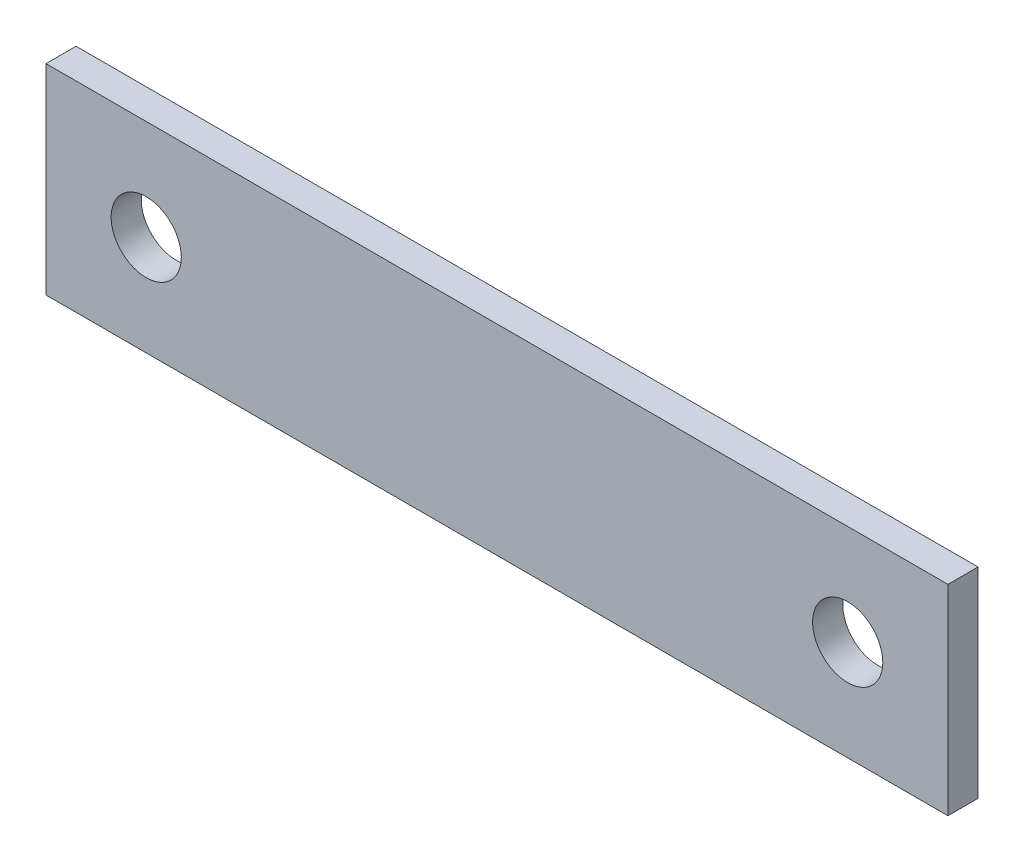
ISO-10303-21;
HEADER;
FILE_DESCRIPTION(('STEP AP214'),'2;1');
FILE_NAME('part.step','',(''),(''),'','','');
FILE_SCHEMA(('AUTOMOTIVE_DESIGN { 1 0 10303 214 1 1 1 1 }'));
ENDSEC;
DATA;
#1=APPLICATION_CONTEXT('core data for automotive mechanical design processes');
#2=APPLICATION_PROTOCOL_DEFINITION('international standard','automotive_design',2000,#1);
#3=PRODUCT_CONTEXT('',#1,'mechanical');
#4=PRODUCT('Part','Part','',(#3));
#5=PRODUCT_RELATED_PRODUCT_CATEGORY('part','',(#4));
#6=PRODUCT_DEFINITION_FORMATION('','',#4);
#7=PRODUCT_DEFINITION_CONTEXT('part definition',#1,'design');
#8=PRODUCT_DEFINITION('design','',#6,#7);
#9=PRODUCT_DEFINITION_SHAPE('','',#8);
#10=(LENGTH_UNIT() NAMED_UNIT(*) SI_UNIT(.MILLI.,.METRE.));
#11=(NAMED_UNIT(*) PLANE_ANGLE_UNIT() SI_UNIT($,.RADIAN.));
#12=(NAMED_UNIT(*) SI_UNIT($,.STERADIAN.) SOLID_ANGLE_UNIT());
#13=UNCERTAINTY_MEASURE_WITH_UNIT(LENGTH_MEASURE(1.E-05),#10,'distance_accuracy_value','');
#14=(GEOMETRIC_REPRESENTATION_CONTEXT(3) GLOBAL_UNCERTAINTY_ASSIGNED_CONTEXT((#13)) GLOBAL_UNIT_ASSIGNED_CONTEXT((#10,
#11,#12)) REPRESENTATION_CONTEXT('',''));
#15=CARTESIAN_POINT('',(0.,0.,0.));
#16=DIRECTION('',(0.,0.,1.));
#17=DIRECTION('',(1.,0.,0.));
#18=AXIS2_PLACEMENT_3D('',#15,#16,#17);
#19=CARTESIAN_POINT('',(0.,0.,3.));
#20=DIRECTION('',(0.,0.,1.));
#21=DIRECTION('',(1.,0.,0.));
#22=AXIS2_PLACEMENT_3D('',#19,#20,#21);
#23=PLANE('',#22);
#24=CARTESIAN_POINT('',(-71.8884938213024,16.0052859618717,3.));
#25=DIRECTION('',(0.,0.,1.));
#26=DIRECTION('',(1.,0.,0.));
#27=AXIS2_PLACEMENT_3D('',#24,#25,#26);
#28=CIRCLE('',#27,3.50000000000001);
#29=CARTESIAN_POINT('',(-68.3884938213024,16.0052859618717,3.));
#30=VERTEX_POINT('',#29);
#31=EDGE_CURVE('E100',#30,#30,#28,.T.);
#32=ORIENTED_EDGE('',*,*,#31,.F.);
#33=EDGE_LOOP('',(#32));
#34=FACE_BOUND('',#33,.T.);
#35=DIRECTION('',(0.,-1.,0.));
#36=VECTOR('',#35,1.);
#37=CARTESIAN_POINT('',(-81.8884938213024,26.0052859618718,3.));
#38=LINE('',#37,#36);
#39=CARTESIAN_POINT('',(-81.8884938213024,26.0052859618718,3.));
#40=VERTEX_POINT('',#39);
#41=CARTESIAN_POINT('',(-81.8884938213024,6.00528596187175,3.));
#42=VERTEX_POINT('',#41);
#43=EDGE_CURVE('E85',#40,#42,#38,.T.);
#44=ORIENTED_EDGE('',*,*,#43,.T.);
#45=DIRECTION('',(1.,0.,0.));
#46=VECTOR('',#45,1.);
#47=CARTESIAN_POINT('',(-81.8884938213024,6.00528596187175,3.));
#48=LINE('',#47,#46);
#49=CARTESIAN_POINT('',(8.11150617869759,6.00528596187175,3.));
#50=VERTEX_POINT('',#49);
#51=EDGE_CURVE('E80',#42,#50,#48,.T.);
#52=ORIENTED_EDGE('',*,*,#51,.T.);
#53=DIRECTION('',(0.,1.,0.));
#54=VECTOR('',#53,1.);
#55=CARTESIAN_POINT('',(8.11150617869757,26.0052859618718,3.));
#56=LINE('',#55,#54);
#57=CARTESIAN_POINT('',(8.11150617869757,26.0052859618718,3.));
#58=VERTEX_POINT('',#57);
#59=EDGE_CURVE('E83',#50,#58,#56,.T.);
#60=ORIENTED_EDGE('',*,*,#59,.T.);
#61=DIRECTION('',(-1.,0.,0.));
#62=VECTOR('',#61,1.);
#63=CARTESIAN_POINT('',(-81.8884938213024,26.0052859618718,3.));
#64=LINE('',#63,#62);
#65=EDGE_CURVE('E50',#58,#40,#64,.T.);
#66=ORIENTED_EDGE('',*,*,#65,.T.);
#67=EDGE_LOOP('',(#44,#52,#60,#66));
#68=FACE_BOUND('',#67,.T.);
#69=CARTESIAN_POINT('',(-1.88849382130241,16.0052859618717,3.));
#70=DIRECTION('',(0.,0.,1.));
#71=DIRECTION('',(1.,0.,0.));
#72=AXIS2_PLACEMENT_3D('',#69,#70,#71);
#73=CIRCLE('',#72,3.50000000000001);
#74=CARTESIAN_POINT('',(1.6115061786976,16.0052859618717,3.));
#75=VERTEX_POINT('',#74);
#76=EDGE_CURVE('E115',#75,#75,#73,.T.);
#77=ORIENTED_EDGE('',*,*,#76,.F.);
#78=EDGE_LOOP('',(#77));
#79=FACE_BOUND('',#78,.T.);
#80=ADVANCED_FACE('F33',(#34,#68,#79),#23,.T.);
#81=CARTESIAN_POINT('',(0.,0.,0.));
#82=DIRECTION('',(0.,0.,1.));
#83=DIRECTION('',(1.,0.,0.));
#84=AXIS2_PLACEMENT_3D('',#81,#82,#83);
#85=PLANE('',#84);
#86=DIRECTION('',(0.,-1.,0.));
#87=VECTOR('',#86,1.);
#88=CARTESIAN_POINT('',(-81.8884938213024,26.0052859618718,0.));
#89=LINE('',#88,#87);
#90=CARTESIAN_POINT('',(-81.8884938213024,26.0052859618718,0.));
#91=VERTEX_POINT('',#90);
#92=CARTESIAN_POINT('',(-81.8884938213024,6.00528596187175,0.));
#93=VERTEX_POINT('',#92);
#94=EDGE_CURVE('E97',#91,#93,#89,.T.);
#95=ORIENTED_EDGE('',*,*,#94,.F.);
#96=DIRECTION('',(-1.,0.,0.));
#97=VECTOR('',#96,1.);
#98=CARTESIAN_POINT('',(-81.8884938213024,26.0052859618718,0.));
#99=LINE('',#98,#97);
#100=CARTESIAN_POINT('',(8.11150617869757,26.0052859618718,0.));
#101=VERTEX_POINT('',#100);
#102=EDGE_CURVE('E73',#101,#91,#99,.T.);
#103=ORIENTED_EDGE('',*,*,#102,.F.);
#104=DIRECTION('',(0.,1.,0.));
#105=VECTOR('',#104,1.);
#106=CARTESIAN_POINT('',(8.11150617869757,26.0052859618718,0.));
#107=LINE('',#106,#105);
#108=CARTESIAN_POINT('',(8.11150617869759,6.00528596187175,0.));
#109=VERTEX_POINT('',#108);
#110=EDGE_CURVE('E67',#109,#101,#107,.T.);
#111=ORIENTED_EDGE('',*,*,#110,.F.);
#112=DIRECTION('',(1.,0.,0.));
#113=VECTOR('',#112,1.);
#114=CARTESIAN_POINT('',(-81.8884938213024,6.00528596187175,0.));
#115=LINE('',#114,#113);
#116=EDGE_CURVE('E89',#93,#109,#115,.T.);
#117=ORIENTED_EDGE('',*,*,#116,.F.);
#118=EDGE_LOOP('',(#95,#103,#111,#117));
#119=FACE_BOUND('',#118,.T.);
#120=CARTESIAN_POINT('',(-71.8884938213024,16.0052859618717,0.));
#121=DIRECTION('',(0.,0.,1.));
#122=DIRECTION('',(1.,0.,0.));
#123=AXIS2_PLACEMENT_3D('',#120,#121,#122);
#124=CIRCLE('',#123,3.50000000000001);
#125=CARTESIAN_POINT('',(-68.3884938213024,16.0052859618717,0.));
#126=VERTEX_POINT('',#125);
#127=EDGE_CURVE('E112',#126,#126,#124,.T.);
#128=ORIENTED_EDGE('',*,*,#127,.T.);
#129=EDGE_LOOP('',(#128));
#130=FACE_BOUND('',#129,.T.);
#131=CARTESIAN_POINT('',(-1.88849382130241,16.0052859618717,0.));
#132=DIRECTION('',(0.,0.,1.));
#133=DIRECTION('',(1.,0.,0.));
#134=AXIS2_PLACEMENT_3D('',#131,#132,#133);
#135=CIRCLE('',#134,3.50000000000001);
#136=CARTESIAN_POINT('',(1.6115061786976,16.0052859618717,0.));
#137=VERTEX_POINT('',#136);
#138=EDGE_CURVE('E118',#137,#137,#135,.T.);
#139=ORIENTED_EDGE('',*,*,#138,.T.);
#140=EDGE_LOOP('',(#139));
#141=FACE_BOUND('',#140,.T.);
#142=ADVANCED_FACE('F108',(#119,#130,#141),#85,.F.);
#143=CARTESIAN_POINT('',(-81.8884938213024,26.0052859618718,3.));
#144=DIRECTION('',(1.,0.,0.));
#145=DIRECTION('',(0.,0.,-1.));
#146=AXIS2_PLACEMENT_3D('',#143,#144,#145);
#147=PLANE('',#146);
#148=ORIENTED_EDGE('',*,*,#94,.T.);
#149=DIRECTION('',(0.,0.,-1.));
#150=VECTOR('',#149,1.);
#151=CARTESIAN_POINT('',(-81.8884938213024,6.00528596187175,3.));
#152=LINE('',#151,#150);
#153=EDGE_CURVE('E11',#42,#93,#152,.T.);
#154=ORIENTED_EDGE('',*,*,#153,.F.);
#155=ORIENTED_EDGE('',*,*,#43,.F.);
#156=DIRECTION('',(0.,0.,-1.));
#157=VECTOR('',#156,1.);
#158=CARTESIAN_POINT('',(-81.8884938213024,26.0052859618718,3.));
#159=LINE('',#158,#157);
#160=EDGE_CURVE('E93',#40,#91,#159,.T.);
#161=ORIENTED_EDGE('',*,*,#160,.T.);
#162=EDGE_LOOP('',(#148,#154,#155,#161));
#163=FACE_BOUND('',#162,.T.);
#164=ADVANCED_FACE('F35',(#163),#147,.F.);
#165=CARTESIAN_POINT('',(-81.8884938213024,6.00528596187175,3.));
#166=DIRECTION('',(0.,1.,0.));
#167=DIRECTION('',(0.,0.,1.));
#168=AXIS2_PLACEMENT_3D('',#165,#166,#167);
#169=PLANE('',#168);
#170=ORIENTED_EDGE('',*,*,#116,.T.);
#171=DIRECTION('',(0.,0.,-1.));
#172=VECTOR('',#171,1.);
#173=CARTESIAN_POINT('',(8.11150617869759,6.00528596187175,3.));
#174=LINE('',#173,#172);
#175=EDGE_CURVE('E42',#50,#109,#174,.T.);
#176=ORIENTED_EDGE('',*,*,#175,.F.);
#177=ORIENTED_EDGE('',*,*,#51,.F.);
#178=ORIENTED_EDGE('',*,*,#153,.T.);
#179=EDGE_LOOP('',(#170,#176,#177,#178));
#180=FACE_BOUND('',#179,.T.);
#181=ADVANCED_FACE('F88',(#180),#169,.F.);
#182=CARTESIAN_POINT('',(8.11150617869757,26.0052859618718,3.));
#183=DIRECTION('',(-1.,0.,0.));
#184=DIRECTION('',(0.,-1.,0.));
#185=AXIS2_PLACEMENT_3D('',#182,#183,#184);
#186=PLANE('',#185);
#187=ORIENTED_EDGE('',*,*,#110,.T.);
#188=DIRECTION('',(0.,0.,-1.));
#189=VECTOR('',#188,1.);
#190=CARTESIAN_POINT('',(8.11150617869757,26.0052859618718,3.));
#191=LINE('',#190,#189);
#192=EDGE_CURVE('E90',#58,#101,#191,.T.);
#193=ORIENTED_EDGE('',*,*,#192,.F.);
#194=ORIENTED_EDGE('',*,*,#59,.F.);
#195=ORIENTED_EDGE('',*,*,#175,.T.);
#196=EDGE_LOOP('',(#187,#193,#194,#195));
#197=FACE_BOUND('',#196,.T.);
#198=ADVANCED_FACE('F91',(#197),#186,.F.);
#199=CARTESIAN_POINT('',(-81.8884938213024,26.0052859618718,3.));
#200=DIRECTION('',(0.,-1.,0.));
#201=DIRECTION('',(0.,0.,-1.));
#202=AXIS2_PLACEMENT_3D('',#199,#200,#201);
#203=PLANE('',#202);
#204=ORIENTED_EDGE('',*,*,#102,.T.);
#205=ORIENTED_EDGE('',*,*,#160,.F.);
#206=ORIENTED_EDGE('',*,*,#65,.F.);
#207=ORIENTED_EDGE('',*,*,#192,.T.);
#208=EDGE_LOOP('',(#204,#205,#206,#207));
#209=FACE_BOUND('',#208,.T.);
#210=ADVANCED_FACE('F105',(#209),#203,.F.);
#211=CARTESIAN_POINT('',(-71.8884938213024,16.0052859618717,3.));
#212=DIRECTION('',(0.,0.,-1.));
#213=DIRECTION('',(-1.,0.,0.));
#214=AXIS2_PLACEMENT_3D('',#211,#212,#213);
#215=CYLINDRICAL_SURFACE('',#214,3.50000000000001);
#216=ORIENTED_EDGE('',*,*,#31,.T.);
#217=EDGE_LOOP('',(#216));
#218=FACE_BOUND('',#217,.T.);
#219=ORIENTED_EDGE('',*,*,#127,.F.);
#220=EDGE_LOOP('',(#219));
#221=FACE_BOUND('',#220,.T.);
#222=ADVANCED_FACE('F135',(#218,#221),#215,.F.);
#223=CARTESIAN_POINT('',(-1.88849382130241,16.0052859618717,3.));
#224=DIRECTION('',(0.,0.,-1.));
#225=DIRECTION('',(-1.,0.,0.));
#226=AXIS2_PLACEMENT_3D('',#223,#224,#225);
#227=CYLINDRICAL_SURFACE('',#226,3.50000000000001);
#228=ORIENTED_EDGE('',*,*,#76,.T.);
#229=EDGE_LOOP('',(#228));
#230=FACE_BOUND('',#229,.T.);
#231=ORIENTED_EDGE('',*,*,#138,.F.);
#232=EDGE_LOOP('',(#231));
#233=FACE_BOUND('',#232,.T.);
#234=ADVANCED_FACE('F124',(#230,#233),#227,.F.);
#235=CLOSED_SHELL('',(#80,#142,#164,#181,#198,#210,#222,#234));
#236=MANIFOLD_SOLID_BREP('B2',#235);
#237=ADVANCED_BREP_SHAPE_REPRESENTATION('',(#18,#236),#14);
#238=SHAPE_DEFINITION_REPRESENTATION(#9,#237);
ENDSEC;
END-ISO-10303-21;
